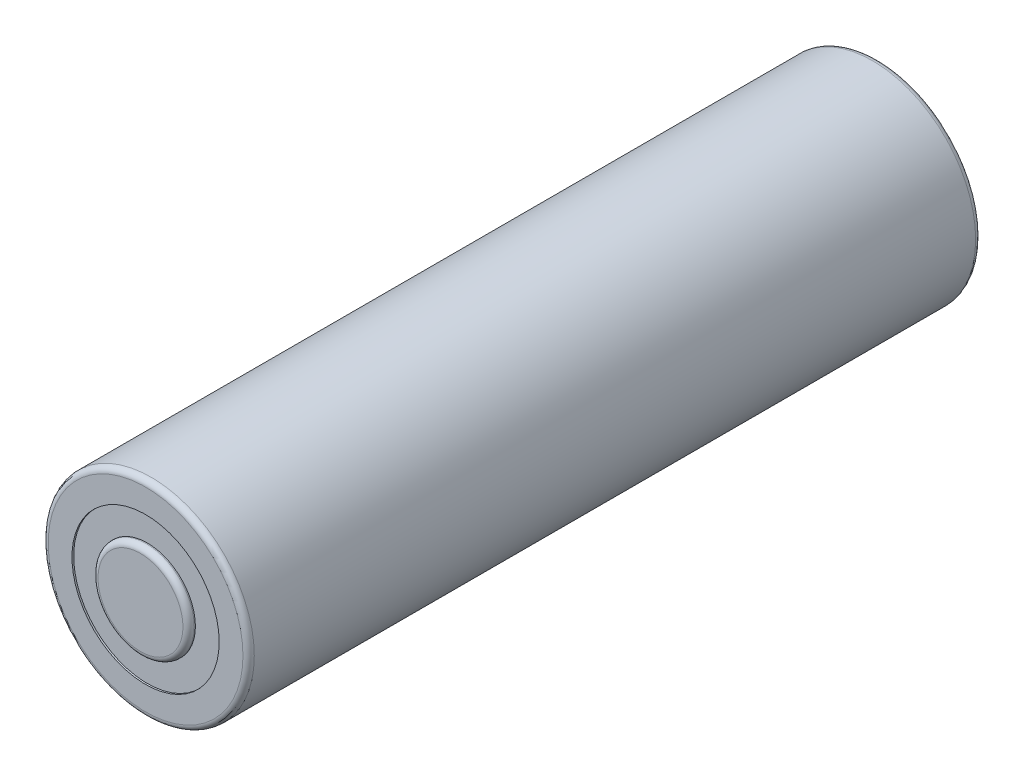
ISO-10303-21;
HEADER;
FILE_DESCRIPTION(('STEP AP214'),'2;1');
FILE_NAME('part.step','',(''),(''),'','','');
FILE_SCHEMA(('AUTOMOTIVE_DESIGN { 1 0 10303 214 1 1 1 1 }'));
ENDSEC;
DATA;
#1=APPLICATION_CONTEXT('core data for automotive mechanical design processes');
#2=APPLICATION_PROTOCOL_DEFINITION('international standard','automotive_design',2000,#1);
#3=PRODUCT_CONTEXT('',#1,'mechanical');
#4=PRODUCT('Part','Part','',(#3));
#5=PRODUCT_RELATED_PRODUCT_CATEGORY('part','',(#4));
#6=PRODUCT_DEFINITION_FORMATION('','',#4);
#7=PRODUCT_DEFINITION_CONTEXT('part definition',#1,'design');
#8=PRODUCT_DEFINITION('design','',#6,#7);
#9=PRODUCT_DEFINITION_SHAPE('','',#8);
#10=(LENGTH_UNIT() NAMED_UNIT(*) SI_UNIT(.MILLI.,.METRE.));
#11=(NAMED_UNIT(*) PLANE_ANGLE_UNIT() SI_UNIT($,.RADIAN.));
#12=(NAMED_UNIT(*) SI_UNIT($,.STERADIAN.) SOLID_ANGLE_UNIT());
#13=UNCERTAINTY_MEASURE_WITH_UNIT(LENGTH_MEASURE(1.E-05),#10,'distance_accuracy_value','');
#14=(GEOMETRIC_REPRESENTATION_CONTEXT(3) GLOBAL_UNCERTAINTY_ASSIGNED_CONTEXT((#13)) GLOBAL_UNIT_ASSIGNED_CONTEXT((#10,
#11,#12)) REPRESENTATION_CONTEXT('',''));
#15=CARTESIAN_POINT('',(0.,0.,0.));
#16=DIRECTION('',(0.,0.,1.));
#17=DIRECTION('',(1.,0.,0.));
#18=AXIS2_PLACEMENT_3D('',#15,#16,#17);
#19=CARTESIAN_POINT('',(-28.8743604465354,15.271996124031,64.7));
#20=DIRECTION('',(0.,0.,-1.));
#21=DIRECTION('',(-1.,0.,0.));
#22=AXIS2_PLACEMENT_3D('',#19,#20,#21);
#23=CYLINDRICAL_SURFACE('',#22,9.1);
#24=CARTESIAN_POINT('',(-28.8743604465354,15.271996124031,64.2));
#25=DIRECTION('',(0.,0.,1.));
#26=DIRECTION('',(1.,0.,0.));
#27=AXIS2_PLACEMENT_3D('',#24,#25,#26);
#28=CIRCLE('',#27,9.1);
#29=CARTESIAN_POINT('',(-19.7743604465354,15.271996124031,64.2));
#30=VERTEX_POINT('',#29);
#31=EDGE_CURVE('E41',#30,#30,#28,.F.);
#32=ORIENTED_EDGE('',*,*,#31,.T.);
#33=EDGE_LOOP('',(#32));
#34=FACE_BOUND('',#33,.T.);
#35=CARTESIAN_POINT('',(-28.8743604465354,15.271996124031,0.5));
#36=DIRECTION('',(0.,0.,1.));
#37=DIRECTION('',(1.,0.,0.));
#38=AXIS2_PLACEMENT_3D('',#35,#36,#37);
#39=CIRCLE('',#38,9.1);
#40=CARTESIAN_POINT('',(-19.7743604465354,15.271996124031,0.5));
#41=VERTEX_POINT('',#40);
#42=EDGE_CURVE('E53',#41,#41,#39,.T.);
#43=ORIENTED_EDGE('',*,*,#42,.T.);
#44=EDGE_LOOP('',(#43));
#45=FACE_BOUND('',#44,.T.);
#46=ADVANCED_FACE('F30',(#34,#45),#23,.T.);
#47=CARTESIAN_POINT('',(-28.8743604465354,15.271996124031,64.7));
#48=DIRECTION('',(0.,0.,1.));
#49=DIRECTION('',(1.,0.,0.));
#50=AXIS2_PLACEMENT_3D('',#47,#48,#49);
#51=PLANE('',#50);
#52=CARTESIAN_POINT('',(-28.8743604465354,15.271996124031,64.7));
#53=DIRECTION('',(0.,0.,1.));
#54=DIRECTION('',(1.,0.,0.));
#55=AXIS2_PLACEMENT_3D('',#52,#53,#54);
#56=CIRCLE('',#55,6.5);
#57=CARTESIAN_POINT('',(-22.3743604465354,15.271996124031,64.7));
#58=VERTEX_POINT('',#57);
#59=EDGE_CURVE('E60',#58,#58,#56,.T.);
#60=ORIENTED_EDGE('',*,*,#59,.F.);
#61=EDGE_LOOP('',(#60));
#62=FACE_BOUND('',#61,.T.);
#63=CARTESIAN_POINT('',(-28.8743604465354,15.271996124031,64.7));
#64=DIRECTION('',(0.,0.,1.));
#65=DIRECTION('',(1.,0.,0.));
#66=AXIS2_PLACEMENT_3D('',#63,#64,#65);
#67=CIRCLE('',#66,8.6);
#68=CARTESIAN_POINT('',(-20.2743604465354,15.271996124031,64.7));
#69=VERTEX_POINT('',#68);
#70=EDGE_CURVE('E45',#69,#69,#67,.T.);
#71=ORIENTED_EDGE('',*,*,#70,.T.);
#72=EDGE_LOOP('',(#71));
#73=FACE_BOUND('',#72,.T.);
#74=ADVANCED_FACE('F89',(#62,#73),#51,.T.);
#75=CARTESIAN_POINT('',(-28.8743604465354,15.271996124031,0.));
#76=DIRECTION('',(0.,0.,1.));
#77=DIRECTION('',(1.,0.,0.));
#78=AXIS2_PLACEMENT_3D('',#75,#76,#77);
#79=PLANE('',#78);
#80=CARTESIAN_POINT('',(-28.8743604465354,15.271996124031,0.));
#81=DIRECTION('',(0.,0.,-1.));
#82=DIRECTION('',(-1.,0.,0.));
#83=AXIS2_PLACEMENT_3D('',#80,#81,#82);
#84=CIRCLE('',#83,6.5);
#85=CARTESIAN_POINT('',(-35.3743604465354,15.271996124031,0.));
#86=VERTEX_POINT('',#85);
#87=EDGE_CURVE('E57',#86,#86,#84,.T.);
#88=ORIENTED_EDGE('',*,*,#87,.F.);
#89=EDGE_LOOP('',(#88));
#90=FACE_BOUND('',#89,.T.);
#91=CARTESIAN_POINT('',(-28.8743604465354,15.271996124031,0.));
#92=DIRECTION('',(0.,0.,1.));
#93=DIRECTION('',(1.,0.,0.));
#94=AXIS2_PLACEMENT_3D('',#91,#92,#93);
#95=CIRCLE('',#94,8.6);
#96=CARTESIAN_POINT('',(-20.2743604465354,15.271996124031,0.));
#97=VERTEX_POINT('',#96);
#98=EDGE_CURVE('E50',#97,#97,#95,.F.);
#99=ORIENTED_EDGE('',*,*,#98,.T.);
#100=EDGE_LOOP('',(#99));
#101=FACE_BOUND('',#100,.T.);
#102=ADVANCED_FACE('F95',(#90,#101),#79,.F.);
#103=CARTESIAN_POINT('',(-28.8743604465354,15.271996124031,0.5));
#104=DIRECTION('',(0.,0.,1.));
#105=DIRECTION('',(1.,0.,0.));
#106=AXIS2_PLACEMENT_3D('',#103,#104,#105);
#107=TOROIDAL_SURFACE('',#106,8.6,0.5);
#108=ORIENTED_EDGE('',*,*,#98,.F.);
#109=EDGE_LOOP('',(#108));
#110=FACE_BOUND('',#109,.T.);
#111=ORIENTED_EDGE('',*,*,#42,.F.);
#112=EDGE_LOOP('',(#111));
#113=FACE_BOUND('',#112,.T.);
#114=ADVANCED_FACE('F101',(#110,#113),#107,.T.);
#115=CARTESIAN_POINT('',(-28.8743604465354,15.271996124031,64.2));
#116=DIRECTION('',(0.,0.,1.));
#117=DIRECTION('',(1.,0.,0.));
#118=AXIS2_PLACEMENT_3D('',#115,#116,#117);
#119=TOROIDAL_SURFACE('',#118,8.6,0.5);
#120=ORIENTED_EDGE('',*,*,#31,.F.);
#121=EDGE_LOOP('',(#120));
#122=FACE_BOUND('',#121,.T.);
#123=ORIENTED_EDGE('',*,*,#70,.F.);
#124=EDGE_LOOP('',(#123));
#125=FACE_BOUND('',#124,.T.);
#126=ADVANCED_FACE('F103',(#122,#125),#119,.T.);
#127=CARTESIAN_POINT('',(-28.8743604465354,15.271996124031,0.35));
#128=DIRECTION('',(0.,0.,-1.));
#129=DIRECTION('',(-1.,0.,0.));
#130=AXIS2_PLACEMENT_3D('',#127,#128,#129);
#131=CYLINDRICAL_SURFACE('',#130,6.5);
#132=CARTESIAN_POINT('',(-28.8743604465354,15.271996124031,0.35));
#133=DIRECTION('',(0.,0.,-1.));
#134=DIRECTION('',(-1.,0.,0.));
#135=AXIS2_PLACEMENT_3D('',#132,#133,#134);
#136=CIRCLE('',#135,6.5);
#137=CARTESIAN_POINT('',(-35.3743604465354,15.271996124031,0.35));
#138=VERTEX_POINT('',#137);
#139=EDGE_CURVE('E56',#138,#138,#136,.T.);
#140=ORIENTED_EDGE('',*,*,#139,.F.);
#141=EDGE_LOOP('',(#140));
#142=FACE_BOUND('',#141,.T.);
#143=ORIENTED_EDGE('',*,*,#87,.T.);
#144=EDGE_LOOP('',(#143));
#145=FACE_BOUND('',#144,.T.);
#146=ADVANCED_FACE('F106',(#142,#145),#131,.F.);
#147=CARTESIAN_POINT('',(-28.8743604465354,15.271996124031,0.35));
#148=DIRECTION('',(0.,0.,-1.));
#149=DIRECTION('',(-1.,0.,0.));
#150=AXIS2_PLACEMENT_3D('',#147,#148,#149);
#151=PLANE('',#150);
#152=ORIENTED_EDGE('',*,*,#139,.T.);
#153=EDGE_LOOP('',(#152));
#154=FACE_BOUND('',#153,.T.);
#155=ADVANCED_FACE('F85',(#154),#151,.T.);
#156=CARTESIAN_POINT('',(-28.8743604465354,15.271996124031,64.35));
#157=DIRECTION('',(0.,0.,1.));
#158=DIRECTION('',(1.,0.,0.));
#159=AXIS2_PLACEMENT_3D('',#156,#157,#158);
#160=CYLINDRICAL_SURFACE('',#159,6.5);
#161=CARTESIAN_POINT('',(-28.8743604465354,15.271996124031,64.55));
#162=DIRECTION('',(0.,0.,1.));
#163=DIRECTION('',(1.,0.,0.));
#164=AXIS2_PLACEMENT_3D('',#161,#162,#163);
#165=CIRCLE('',#164,6.5);
#166=CARTESIAN_POINT('',(-22.3743604465354,15.271996124031,64.55));
#167=VERTEX_POINT('',#166);
#168=EDGE_CURVE('E65',#167,#167,#165,.T.);
#169=ORIENTED_EDGE('',*,*,#168,.F.);
#170=EDGE_LOOP('',(#169));
#171=FACE_BOUND('',#170,.T.);
#172=ORIENTED_EDGE('',*,*,#59,.T.);
#173=EDGE_LOOP('',(#172));
#174=FACE_BOUND('',#173,.T.);
#175=ADVANCED_FACE('F77',(#171,#174),#160,.F.);
#176=CARTESIAN_POINT('',(-28.8743604465354,15.271996124031,64.55));
#177=DIRECTION('',(0.,0.,1.));
#178=DIRECTION('',(1.,0.,0.));
#179=AXIS2_PLACEMENT_3D('',#176,#177,#178);
#180=PLANE('',#179);
#181=ORIENTED_EDGE('',*,*,#168,.T.);
#182=EDGE_LOOP('',(#181));
#183=FACE_BOUND('',#182,.T.);
#184=CARTESIAN_POINT('',(-28.8743604465354,15.271996124031,64.55));
#185=DIRECTION('',(0.,0.,1.));
#186=DIRECTION('',(1.,0.,0.));
#187=AXIS2_PLACEMENT_3D('',#184,#185,#186);
#188=CIRCLE('',#187,4.25);
#189=CARTESIAN_POINT('',(-24.6243604465354,15.271996124031,64.55));
#190=VERTEX_POINT('',#189);
#191=EDGE_CURVE('E68',#190,#190,#188,.T.);
#192=ORIENTED_EDGE('',*,*,#191,.F.);
#193=EDGE_LOOP('',(#192));
#194=FACE_BOUND('',#193,.T.);
#195=ADVANCED_FACE('F74',(#183,#194),#180,.T.);
#196=CARTESIAN_POINT('',(-28.8743604465354,15.271996124031,65.15));
#197=DIRECTION('',(0.,0.,1.));
#198=DIRECTION('',(1.,0.,0.));
#199=AXIS2_PLACEMENT_3D('',#196,#197,#198);
#200=PLANE('',#199);
#201=CARTESIAN_POINT('',(-28.8743604465354,15.271996124031,65.15));
#202=DIRECTION('',(0.,0.,1.));
#203=DIRECTION('',(1.,0.,0.));
#204=AXIS2_PLACEMENT_3D('',#201,#202,#203);
#205=CIRCLE('',#204,3.75);
#206=CARTESIAN_POINT('',(-25.1243604465354,15.271996124031,65.15));
#207=VERTEX_POINT('',#206);
#208=EDGE_CURVE('E37',#207,#207,#205,.T.);
#209=ORIENTED_EDGE('',*,*,#208,.T.);
#210=EDGE_LOOP('',(#209));
#211=FACE_BOUND('',#210,.T.);
#212=ADVANCED_FACE('F76',(#211),#200,.T.);
#213=CARTESIAN_POINT('',(-28.8743604465354,15.271996124031,64.65));
#214=DIRECTION('',(0.,0.,1.));
#215=DIRECTION('',(1.,0.,0.));
#216=AXIS2_PLACEMENT_3D('',#213,#214,#215);
#217=TOROIDAL_SURFACE('',#216,3.75,0.5);
#218=CARTESIAN_POINT('',(-28.8743604465354,15.271996124031,64.65));
#219=DIRECTION('',(0.,0.,1.));
#220=DIRECTION('',(1.,0.,0.));
#221=AXIS2_PLACEMENT_3D('',#218,#219,#220);
#222=CIRCLE('',#221,4.25);
#223=CARTESIAN_POINT('',(-24.6243604465354,15.271996124031,64.65));
#224=VERTEX_POINT('',#223);
#225=EDGE_CURVE('E10',#224,#224,#222,.F.);
#226=ORIENTED_EDGE('',*,*,#225,.F.);
#227=EDGE_LOOP('',(#226));
#228=FACE_BOUND('',#227,.T.);
#229=ORIENTED_EDGE('',*,*,#208,.F.);
#230=EDGE_LOOP('',(#229));
#231=FACE_BOUND('',#230,.T.);
#232=ADVANCED_FACE('F32',(#228,#231),#217,.T.);
#233=CARTESIAN_POINT('',(-28.8743604465354,15.271996124031,65.15));
#234=DIRECTION('',(0.,0.,-1.));
#235=DIRECTION('',(-1.,0.,0.));
#236=AXIS2_PLACEMENT_3D('',#233,#234,#235);
#237=CYLINDRICAL_SURFACE('',#236,4.25);
#238=ORIENTED_EDGE('',*,*,#191,.T.);
#239=EDGE_LOOP('',(#238));
#240=FACE_BOUND('',#239,.T.);
#241=ORIENTED_EDGE('',*,*,#225,.T.);
#242=EDGE_LOOP('',(#241));
#243=FACE_BOUND('',#242,.T.);
#244=ADVANCED_FACE('F72',(#240,#243),#237,.T.);
#245=CLOSED_SHELL('',(#46,#74,#102,#114,#126,#146,#155,#175,#195,#212,#232,#244));
#246=MANIFOLD_SOLID_BREP('B2',#245);
#247=ADVANCED_BREP_SHAPE_REPRESENTATION('',(#18,#246),#14);
#248=SHAPE_DEFINITION_REPRESENTATION(#9,#247);
ENDSEC;
END-ISO-10303-21;
